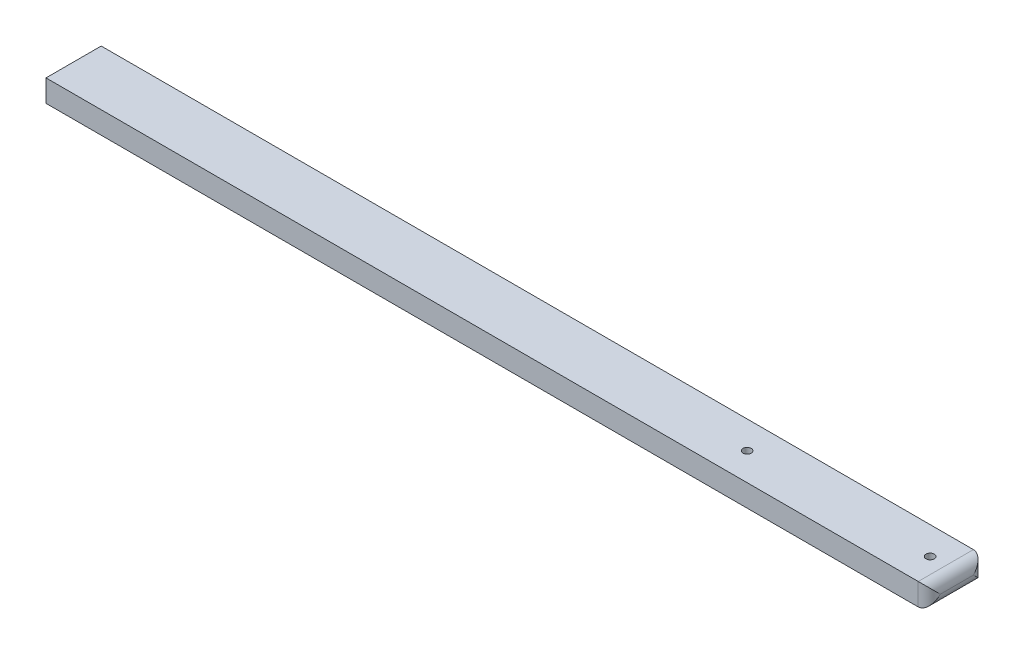
ISO-10303-21;
HEADER;
FILE_DESCRIPTION(('STEP AP214'),'2;1');
FILE_NAME('part.step','',(''),(''),'','','');
FILE_SCHEMA(('AUTOMOTIVE_DESIGN { 1 0 10303 214 1 1 1 1 }'));
ENDSEC;
DATA;
#1=APPLICATION_CONTEXT('core data for automotive mechanical design processes');
#2=APPLICATION_PROTOCOL_DEFINITION('international standard','automotive_design',2000,#1);
#3=PRODUCT_CONTEXT('',#1,'mechanical');
#4=PRODUCT('Part','Part','',(#3));
#5=PRODUCT_RELATED_PRODUCT_CATEGORY('part','',(#4));
#6=PRODUCT_DEFINITION_FORMATION('','',#4);
#7=PRODUCT_DEFINITION_CONTEXT('part definition',#1,'design');
#8=PRODUCT_DEFINITION('design','',#6,#7);
#9=PRODUCT_DEFINITION_SHAPE('','',#8);
#10=(LENGTH_UNIT() NAMED_UNIT(*) SI_UNIT(.MILLI.,.METRE.));
#11=(NAMED_UNIT(*) PLANE_ANGLE_UNIT() SI_UNIT($,.RADIAN.));
#12=(NAMED_UNIT(*) SI_UNIT($,.STERADIAN.) SOLID_ANGLE_UNIT());
#13=UNCERTAINTY_MEASURE_WITH_UNIT(LENGTH_MEASURE(1.E-05),#10,'distance_accuracy_value','');
#14=(GEOMETRIC_REPRESENTATION_CONTEXT(3) GLOBAL_UNCERTAINTY_ASSIGNED_CONTEXT((#13)) GLOBAL_UNIT_ASSIGNED_CONTEXT((#10,
#11,#12)) REPRESENTATION_CONTEXT('',''));
#15=CARTESIAN_POINT('',(0.,0.,0.));
#16=DIRECTION('',(0.,0.,1.));
#17=DIRECTION('',(1.,0.,0.));
#18=AXIS2_PLACEMENT_3D('',#15,#16,#17);
#19=CARTESIAN_POINT('',(-80.,4.,-5.));
#20=DIRECTION('',(0.,0.,1.));
#21=DIRECTION('',(1.,0.,0.));
#22=AXIS2_PLACEMENT_3D('',#19,#20,#21);
#23=PLANE('',#22);
#24=DIRECTION('',(-1.,0.,0.));
#25=VECTOR('',#24,1.);
#26=CARTESIAN_POINT('',(-80.,4.,-5.));
#27=LINE('',#26,#25);
#28=CARTESIAN_POINT('',(78.,4.,-5.));
#29=VERTEX_POINT('',#28);
#30=CARTESIAN_POINT('',(-80.,4.,-5.));
#31=VERTEX_POINT('',#30);
#32=EDGE_CURVE('E131',#29,#31,#27,.T.);
#33=ORIENTED_EDGE('',*,*,#32,.F.);
#34=DIRECTION('',(0.,-1.,0.));
#35=VECTOR('',#34,1.);
#36=CARTESIAN_POINT('',(78.,4.,-5.));
#37=LINE('',#36,#35);
#38=CARTESIAN_POINT('',(78.,0.,-5.));
#39=VERTEX_POINT('',#38);
#40=EDGE_CURVE('E117',#29,#39,#37,.T.);
#41=ORIENTED_EDGE('',*,*,#40,.T.);
#42=DIRECTION('',(-1.,0.,0.));
#43=VECTOR('',#42,1.);
#44=CARTESIAN_POINT('',(-80.,0.,-5.));
#45=LINE('',#44,#43);
#46=CARTESIAN_POINT('',(-80.,0.,-5.));
#47=VERTEX_POINT('',#46);
#48=EDGE_CURVE('E83',#39,#47,#45,.T.);
#49=ORIENTED_EDGE('',*,*,#48,.T.);
#50=DIRECTION('',(0.,-1.,0.));
#51=VECTOR('',#50,1.);
#52=CARTESIAN_POINT('',(-80.,4.,-5.));
#53=LINE('',#52,#51);
#54=EDGE_CURVE('E118',#31,#47,#53,.T.);
#55=ORIENTED_EDGE('',*,*,#54,.F.);
#56=EDGE_LOOP('',(#33,#41,#49,#55));
#57=FACE_BOUND('',#56,.T.);
#58=ADVANCED_FACE('F39',(#57),#23,.F.);
#59=CARTESIAN_POINT('',(-80.,4.,-5.));
#60=DIRECTION('',(1.,0.,0.));
#61=DIRECTION('',(0.,0.,-1.));
#62=AXIS2_PLACEMENT_3D('',#59,#60,#61);
#63=PLANE('',#62);
#64=DIRECTION('',(0.,0.,1.));
#65=VECTOR('',#64,1.);
#66=CARTESIAN_POINT('',(-80.,0.,-5.));
#67=LINE('',#66,#65);
#68=CARTESIAN_POINT('',(-80.,0.,5.));
#69=VERTEX_POINT('',#68);
#70=EDGE_CURVE('E137',#47,#69,#67,.T.);
#71=ORIENTED_EDGE('',*,*,#70,.T.);
#72=DIRECTION('',(0.,-1.,0.));
#73=VECTOR('',#72,1.);
#74=CARTESIAN_POINT('',(-80.,4.,5.));
#75=LINE('',#74,#73);
#76=CARTESIAN_POINT('',(-80.,4.,5.));
#77=VERTEX_POINT('',#76);
#78=EDGE_CURVE('E126',#77,#69,#75,.T.);
#79=ORIENTED_EDGE('',*,*,#78,.F.);
#80=DIRECTION('',(0.,0.,1.));
#81=VECTOR('',#80,1.);
#82=CARTESIAN_POINT('',(-80.,4.,-5.));
#83=LINE('',#82,#81);
#84=EDGE_CURVE('E123',#31,#77,#83,.T.);
#85=ORIENTED_EDGE('',*,*,#84,.F.);
#86=ORIENTED_EDGE('',*,*,#54,.T.);
#87=EDGE_LOOP('',(#71,#79,#85,#86));
#88=FACE_BOUND('',#87,.T.);
#89=ADVANCED_FACE('F174',(#88),#63,.F.);
#90=CARTESIAN_POINT('',(-80.,4.,5.));
#91=DIRECTION('',(0.,0.,-1.));
#92=DIRECTION('',(-1.,0.,0.));
#93=AXIS2_PLACEMENT_3D('',#90,#91,#92);
#94=PLANE('',#93);
#95=DIRECTION('',(1.,0.,0.));
#96=VECTOR('',#95,1.);
#97=CARTESIAN_POINT('',(-80.,0.,5.));
#98=LINE('',#97,#96);
#99=CARTESIAN_POINT('',(78.,0.,5.));
#100=VERTEX_POINT('',#99);
#101=EDGE_CURVE('E115',#69,#100,#98,.T.);
#102=ORIENTED_EDGE('',*,*,#101,.T.);
#103=DIRECTION('',(0.,-1.,0.));
#104=VECTOR('',#103,1.);
#105=CARTESIAN_POINT('',(78.,4.,5.));
#106=LINE('',#105,#104);
#107=CARTESIAN_POINT('',(78.,4.,5.));
#108=VERTEX_POINT('',#107);
#109=EDGE_CURVE('E101',#100,#108,#106,.F.);
#110=ORIENTED_EDGE('',*,*,#109,.T.);
#111=DIRECTION('',(1.,0.,0.));
#112=VECTOR('',#111,1.);
#113=CARTESIAN_POINT('',(-80.,4.,5.));
#114=LINE('',#113,#112);
#115=EDGE_CURVE('E113',#77,#108,#114,.T.);
#116=ORIENTED_EDGE('',*,*,#115,.F.);
#117=ORIENTED_EDGE('',*,*,#78,.T.);
#118=EDGE_LOOP('',(#102,#110,#116,#117));
#119=FACE_BOUND('',#118,.T.);
#120=ADVANCED_FACE('F111',(#119),#94,.F.);
#121=CARTESIAN_POINT('',(0.,4.,0.));
#122=DIRECTION('',(0.,1.,0.));
#123=DIRECTION('',(0.,0.,1.));
#124=AXIS2_PLACEMENT_3D('',#121,#122,#123);
#125=PLANE('',#124);
#126=CARTESIAN_POINT('',(75.16,4.,0.));
#127=DIRECTION('',(0.,1.,0.));
#128=DIRECTION('',(0.,0.,1.));
#129=AXIS2_PLACEMENT_3D('',#126,#127,#128);
#130=CIRCLE('',#129,0.749999999999999);
#131=CARTESIAN_POINT('',(75.16,4.,0.749999999999999));
#132=VERTEX_POINT('',#131);
#133=EDGE_CURVE('E149',#132,#132,#130,.T.);
#134=ORIENTED_EDGE('',*,*,#133,.F.);
#135=EDGE_LOOP('',(#134));
#136=FACE_BOUND('',#135,.T.);
#137=CARTESIAN_POINT('',(42.,4.,0.));
#138=DIRECTION('',(0.,1.,0.));
#139=DIRECTION('',(0.,0.,1.));
#140=AXIS2_PLACEMENT_3D('',#137,#138,#139);
#141=CIRCLE('',#140,0.749999999999999);
#142=CARTESIAN_POINT('',(42.,4.,0.749999999999999));
#143=VERTEX_POINT('',#142);
#144=EDGE_CURVE('E162',#143,#143,#141,.T.);
#145=ORIENTED_EDGE('',*,*,#144,.F.);
#146=EDGE_LOOP('',(#145));
#147=FACE_BOUND('',#146,.T.);
#148=ORIENTED_EDGE('',*,*,#115,.T.);
#149=DIRECTION('',(0.,0.,-1.));
#150=VECTOR('',#149,1.);
#151=CARTESIAN_POINT('',(78.,4.,-5.));
#152=LINE('',#151,#150);
#153=EDGE_CURVE('E11',#108,#29,#152,.T.);
#154=ORIENTED_EDGE('',*,*,#153,.T.);
#155=ORIENTED_EDGE('',*,*,#32,.T.);
#156=ORIENTED_EDGE('',*,*,#84,.T.);
#157=EDGE_LOOP('',(#148,#154,#155,#156));
#158=FACE_BOUND('',#157,.T.);
#159=ADVANCED_FACE('F121',(#136,#147,#158),#125,.T.);
#160=CARTESIAN_POINT('',(0.,0.,0.));
#161=DIRECTION('',(0.,1.,0.));
#162=DIRECTION('',(0.,0.,1.));
#163=AXIS2_PLACEMENT_3D('',#160,#161,#162);
#164=PLANE('',#163);
#165=CARTESIAN_POINT('',(75.16,0.,0.));
#166=DIRECTION('',(0.,1.,0.));
#167=DIRECTION('',(0.,0.,1.));
#168=AXIS2_PLACEMENT_3D('',#165,#166,#167);
#169=CIRCLE('',#168,0.749999999999999);
#170=CARTESIAN_POINT('',(75.16,0.,0.749999999999999));
#171=VERTEX_POINT('',#170);
#172=EDGE_CURVE('E138',#171,#171,#169,.T.);
#173=ORIENTED_EDGE('',*,*,#172,.T.);
#174=EDGE_LOOP('',(#173));
#175=FACE_BOUND('',#174,.T.);
#176=CARTESIAN_POINT('',(42.,0.,0.));
#177=DIRECTION('',(0.,1.,0.));
#178=DIRECTION('',(0.,0.,1.));
#179=AXIS2_PLACEMENT_3D('',#176,#177,#178);
#180=CIRCLE('',#179,0.749999999999999);
#181=CARTESIAN_POINT('',(42.,0.,0.749999999999999));
#182=VERTEX_POINT('',#181);
#183=EDGE_CURVE('E145',#182,#182,#180,.T.);
#184=ORIENTED_EDGE('',*,*,#183,.T.);
#185=EDGE_LOOP('',(#184));
#186=FACE_BOUND('',#185,.T.);
#187=ORIENTED_EDGE('',*,*,#48,.F.);
#188=DIRECTION('',(0.,0.,-1.));
#189=VECTOR('',#188,1.);
#190=CARTESIAN_POINT('',(78.,0.,0.));
#191=LINE('',#190,#189);
#192=EDGE_CURVE('E50',#39,#100,#191,.F.);
#193=ORIENTED_EDGE('',*,*,#192,.T.);
#194=ORIENTED_EDGE('',*,*,#101,.F.);
#195=ORIENTED_EDGE('',*,*,#70,.F.);
#196=EDGE_LOOP('',(#187,#193,#194,#195));
#197=FACE_BOUND('',#196,.T.);
#198=ADVANCED_FACE('F176',(#175,#186,#197),#164,.F.);
#199=CARTESIAN_POINT('',(42.,-10.,0.));
#200=DIRECTION('',(0.,1.,0.));
#201=DIRECTION('',(0.,0.,1.));
#202=AXIS2_PLACEMENT_3D('',#199,#200,#201);
#203=CYLINDRICAL_SURFACE('',#202,0.749999999999999);
#204=ORIENTED_EDGE('',*,*,#144,.T.);
#205=EDGE_LOOP('',(#204));
#206=FACE_BOUND('',#205,.T.);
#207=ORIENTED_EDGE('',*,*,#183,.F.);
#208=EDGE_LOOP('',(#207));
#209=FACE_BOUND('',#208,.T.);
#210=ADVANCED_FACE('F185',(#206,#209),#203,.F.);
#211=CARTESIAN_POINT('',(75.16,-10.,0.));
#212=DIRECTION('',(0.,1.,0.));
#213=DIRECTION('',(0.,0.,1.));
#214=AXIS2_PLACEMENT_3D('',#211,#212,#213);
#215=CYLINDRICAL_SURFACE('',#214,0.749999999999999);
#216=ORIENTED_EDGE('',*,*,#133,.T.);
#217=EDGE_LOOP('',(#216));
#218=FACE_BOUND('',#217,.T.);
#219=ORIENTED_EDGE('',*,*,#172,.F.);
#220=EDGE_LOOP('',(#219));
#221=FACE_BOUND('',#220,.T.);
#222=ADVANCED_FACE('F180',(#218,#221),#215,.F.);
#223=CARTESIAN_POINT('',(78.,4.,-3.));
#224=DIRECTION('',(0.,-1.,0.));
#225=DIRECTION('',(0.,0.,-1.));
#226=AXIS2_PLACEMENT_3D('',#223,#224,#225);
#227=CYLINDRICAL_SURFACE('',#226,2.);
#228=CARTESIAN_POINT('',(78.,2.,-3.));
#229=DIRECTION('',(0.,0.707106781186547,-0.707106781186547));
#230=DIRECTION('',(0.,-0.707106781186547,-0.707106781186547));
#231=AXIS2_PLACEMENT_3D('',#228,#229,#230);
#232=ELLIPSE('',#231,2.82842712474619,2.);
#233=CARTESIAN_POINT('',(80.,2.,-3.));
#234=VERTEX_POINT('',#233);
#235=EDGE_CURVE('E105',#39,#234,#232,.F.);
#236=ORIENTED_EDGE('',*,*,#235,.F.);
#237=ORIENTED_EDGE('',*,*,#40,.F.);
#238=CARTESIAN_POINT('',(78.,2.,-3.));
#239=DIRECTION('',(0.,0.707106781186547,0.707106781186547));
#240=DIRECTION('',(0.,-0.707106781186547,0.707106781186547));
#241=AXIS2_PLACEMENT_3D('',#238,#239,#240);
#242=ELLIPSE('',#241,2.82842712474619,2.);
#243=EDGE_CURVE('E43',#234,#29,#242,.T.);
#244=ORIENTED_EDGE('',*,*,#243,.F.);
#245=EDGE_LOOP('',(#236,#237,#244));
#246=FACE_BOUND('',#245,.T.);
#247=ADVANCED_FACE('F41',(#246),#227,.T.);
#248=CARTESIAN_POINT('',(78.,2.,0.));
#249=DIRECTION('',(0.,0.,1.));
#250=DIRECTION('',(1.,0.,0.));
#251=AXIS2_PLACEMENT_3D('',#248,#249,#250);
#252=CYLINDRICAL_SURFACE('',#251,2.);
#253=DIRECTION('',(0.,0.,-1.));
#254=VECTOR('',#253,1.);
#255=CARTESIAN_POINT('',(80.,2.,5.));
#256=LINE('',#255,#254);
#257=CARTESIAN_POINT('',(80.,2.,3.));
#258=VERTEX_POINT('',#257);
#259=EDGE_CURVE('E69',#234,#258,#256,.F.);
#260=ORIENTED_EDGE('',*,*,#259,.F.);
#261=ORIENTED_EDGE('',*,*,#243,.T.);
#262=ORIENTED_EDGE('',*,*,#153,.F.);
#263=CARTESIAN_POINT('',(78.,2.,3.));
#264=DIRECTION('',(0.,-0.707106781186547,0.707106781186547));
#265=DIRECTION('',(0.,0.707106781186547,0.707106781186547));
#266=AXIS2_PLACEMENT_3D('',#263,#264,#265);
#267=ELLIPSE('',#266,2.82842712474619,2.);
#268=EDGE_CURVE('E98',#258,#108,#267,.T.);
#269=ORIENTED_EDGE('',*,*,#268,.F.);
#270=EDGE_LOOP('',(#260,#261,#262,#269));
#271=FACE_BOUND('',#270,.T.);
#272=ADVANCED_FACE('F107',(#271),#252,.T.);
#273=CARTESIAN_POINT('',(78.,2.,-5.));
#274=DIRECTION('',(0.,0.,-1.));
#275=DIRECTION('',(-1.,0.,0.));
#276=AXIS2_PLACEMENT_3D('',#273,#274,#275);
#277=CYLINDRICAL_SURFACE('',#276,2.);
#278=ORIENTED_EDGE('',*,*,#235,.T.);
#279=ORIENTED_EDGE('',*,*,#259,.T.);
#280=CARTESIAN_POINT('',(78.,2.,3.));
#281=DIRECTION('',(0.,-0.707106781186547,-0.707106781186547));
#282=DIRECTION('',(0.,0.707106781186547,-0.707106781186547));
#283=AXIS2_PLACEMENT_3D('',#280,#281,#282);
#284=ELLIPSE('',#283,2.82842712474619,2.);
#285=EDGE_CURVE('E102',#100,#258,#284,.F.);
#286=ORIENTED_EDGE('',*,*,#285,.F.);
#287=ORIENTED_EDGE('',*,*,#192,.F.);
#288=EDGE_LOOP('',(#278,#279,#286,#287));
#289=FACE_BOUND('',#288,.T.);
#290=ADVANCED_FACE('F178',(#289),#277,.T.);
#291=CARTESIAN_POINT('',(78.,4.,3.));
#292=DIRECTION('',(0.,-1.,0.));
#293=DIRECTION('',(0.,0.,-1.));
#294=AXIS2_PLACEMENT_3D('',#291,#292,#293);
#295=CYLINDRICAL_SURFACE('',#294,2.);
#296=ORIENTED_EDGE('',*,*,#268,.T.);
#297=ORIENTED_EDGE('',*,*,#109,.F.);
#298=ORIENTED_EDGE('',*,*,#285,.T.);
#299=EDGE_LOOP('',(#296,#297,#298));
#300=FACE_BOUND('',#299,.T.);
#301=ADVANCED_FACE('F99',(#300),#295,.T.);
#302=CLOSED_SHELL('',(#58,#89,#120,#159,#198,#210,#222,#247,#272,#290,#301));
#303=MANIFOLD_SOLID_BREP('B2',#302);
#304=ADVANCED_BREP_SHAPE_REPRESENTATION('',(#18,#303),#14);
#305=SHAPE_DEFINITION_REPRESENTATION(#9,#304);
ENDSEC;
END-ISO-10303-21;
